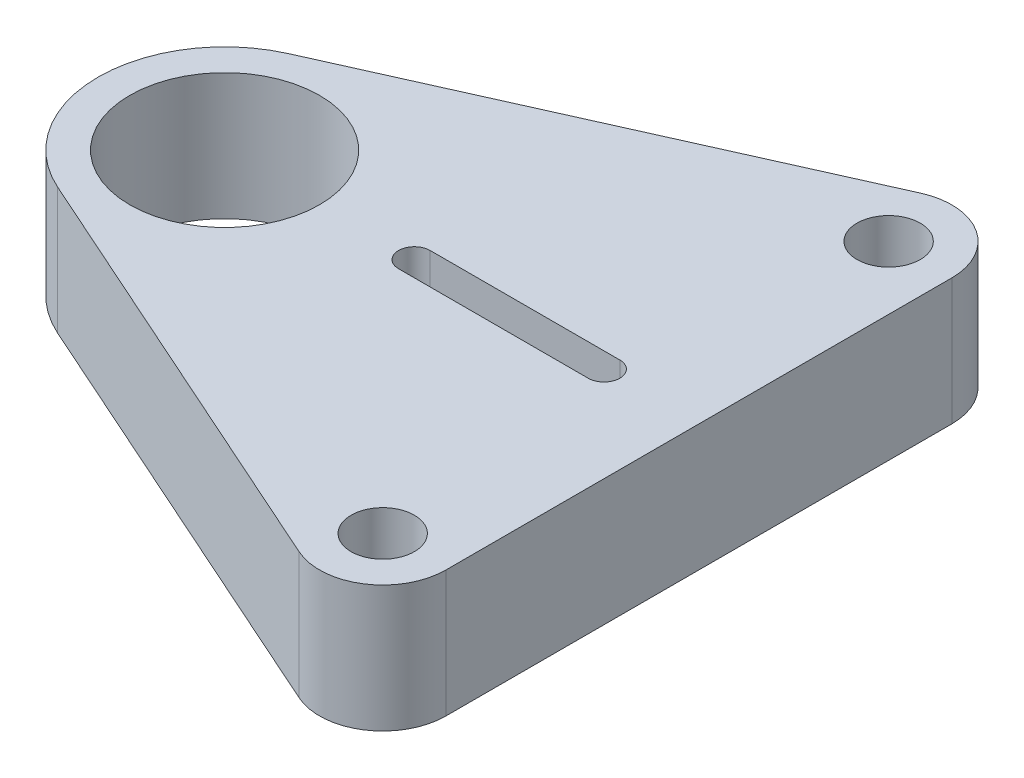
ISO-10303-21;
HEADER;
FILE_DESCRIPTION(('STEP AP214'),'2;1');
FILE_NAME('part.step','',(''),(''),'','','');
FILE_SCHEMA(('AUTOMOTIVE_DESIGN { 1 0 10303 214 1 1 1 1 }'));
ENDSEC;
DATA;
#1=APPLICATION_CONTEXT('core data for automotive mechanical design processes');
#2=APPLICATION_PROTOCOL_DEFINITION('international standard','automotive_design',2000,#1);
#3=PRODUCT_CONTEXT('',#1,'mechanical');
#4=PRODUCT('Part','Part','',(#3));
#5=PRODUCT_RELATED_PRODUCT_CATEGORY('part','',(#4));
#6=PRODUCT_DEFINITION_FORMATION('','',#4);
#7=PRODUCT_DEFINITION_CONTEXT('part definition',#1,'design');
#8=PRODUCT_DEFINITION('design','',#6,#7);
#9=PRODUCT_DEFINITION_SHAPE('','',#8);
#10=(LENGTH_UNIT() NAMED_UNIT(*) SI_UNIT(.MILLI.,.METRE.));
#11=(NAMED_UNIT(*) PLANE_ANGLE_UNIT() SI_UNIT($,.RADIAN.));
#12=(NAMED_UNIT(*) SI_UNIT($,.STERADIAN.) SOLID_ANGLE_UNIT());
#13=UNCERTAINTY_MEASURE_WITH_UNIT(LENGTH_MEASURE(1.E-05),#10,'distance_accuracy_value','');
#14=(GEOMETRIC_REPRESENTATION_CONTEXT(3) GLOBAL_UNCERTAINTY_ASSIGNED_CONTEXT((#13)) GLOBAL_UNIT_ASSIGNED_CONTEXT((#10,
#11,#12)) REPRESENTATION_CONTEXT('',''));
#15=CARTESIAN_POINT('',(0.,0.,0.));
#16=DIRECTION('',(0.,0.,1.));
#17=DIRECTION('',(1.,0.,0.));
#18=AXIS2_PLACEMENT_3D('',#15,#16,#17);
#19=CARTESIAN_POINT('',(0.,-20.,0.));
#20=DIRECTION('',(0.,1.,0.));
#21=DIRECTION('',(0.,0.,1.));
#22=AXIS2_PLACEMENT_3D('',#19,#20,#21);
#23=CYLINDRICAL_SURFACE('',#22,40.);
#24=DIRECTION('',(0.,1.,0.));
#25=VECTOR('',#24,1.);
#26=CARTESIAN_POINT('',(-16.3196510907077,-20.,36.5194330224001));
#27=LINE('',#26,#25);
#28=CARTESIAN_POINT('',(-16.3196510907077,-20.,36.5194330224001));
#29=VERTEX_POINT('',#28);
#30=CARTESIAN_POINT('',(-16.3196510907077,20.,36.5194330224001));
#31=VERTEX_POINT('',#30);
#32=EDGE_CURVE('E46',#29,#31,#27,.T.);
#33=ORIENTED_EDGE('',*,*,#32,.T.);
#34=CARTESIAN_POINT('',(0.,20.,0.));
#35=DIRECTION('',(0.,1.,0.));
#36=DIRECTION('',(0.,0.,1.));
#37=AXIS2_PLACEMENT_3D('',#34,#35,#36);
#38=CIRCLE('',#37,40.);
#39=CARTESIAN_POINT('',(-16.3196510907077,20.,-36.5194330224));
#40=VERTEX_POINT('',#39);
#41=EDGE_CURVE('E168',#40,#31,#38,.T.);
#42=ORIENTED_EDGE('',*,*,#41,.F.);
#43=DIRECTION('',(0.,1.,0.));
#44=VECTOR('',#43,1.);
#45=CARTESIAN_POINT('',(-16.3196510907077,-20.,-36.5194330224));
#46=LINE('',#45,#44);
#47=CARTESIAN_POINT('',(-16.3196510907077,-20.,-36.5194330224));
#48=VERTEX_POINT('',#47);
#49=EDGE_CURVE('E11',#48,#40,#46,.T.);
#50=ORIENTED_EDGE('',*,*,#49,.F.);
#51=CARTESIAN_POINT('',(0.,-20.,0.));
#52=DIRECTION('',(0.,1.,0.));
#53=DIRECTION('',(0.,0.,1.));
#54=AXIS2_PLACEMENT_3D('',#51,#52,#53);
#55=CIRCLE('',#54,40.);
#56=EDGE_CURVE('E221',#48,#29,#55,.T.);
#57=ORIENTED_EDGE('',*,*,#56,.T.);
#58=EDGE_LOOP('',(#33,#42,#50,#57));
#59=FACE_BOUND('',#58,.T.);
#60=ADVANCED_FACE('F43',(#59),#23,.T.);
#61=CARTESIAN_POINT('',(121.840174454646,-20.,-98.2597165112));
#62=DIRECTION('',(-0.407991277267693,0.,-0.912985825560001));
#63=DIRECTION('',(-0.912985825560001,0.,0.407991277267693));
#64=AXIS2_PLACEMENT_3D('',#61,#62,#63);
#65=PLANE('',#64);
#66=ORIENTED_EDGE('',*,*,#49,.T.);
#67=DIRECTION('',(-0.912985825560001,0.,0.407991277267693));
#68=VECTOR('',#67,1.);
#69=CARTESIAN_POINT('',(121.840174454646,20.,-98.2597165112));
#70=LINE('',#69,#68);
#71=CARTESIAN_POINT('',(121.840174454646,20.,-98.2597165112));
#72=VERTEX_POINT('',#71);
#73=EDGE_CURVE('E188',#72,#40,#70,.T.);
#74=ORIENTED_EDGE('',*,*,#73,.F.);
#75=DIRECTION('',(0.,1.,0.));
#76=VECTOR('',#75,1.);
#77=CARTESIAN_POINT('',(121.840174454646,-20.,-98.2597165112));
#78=LINE('',#77,#76);
#79=CARTESIAN_POINT('',(121.840174454646,-20.,-98.2597165112));
#80=VERTEX_POINT('',#79);
#81=EDGE_CURVE('E52',#80,#72,#78,.T.);
#82=ORIENTED_EDGE('',*,*,#81,.F.);
#83=DIRECTION('',(-0.912985825560001,0.,0.407991277267693));
#84=VECTOR('',#83,1.);
#85=CARTESIAN_POINT('',(121.840174454646,-20.,-98.2597165112));
#86=LINE('',#85,#84);
#87=EDGE_CURVE('E240',#80,#48,#86,.T.);
#88=ORIENTED_EDGE('',*,*,#87,.T.);
#89=EDGE_LOOP('',(#66,#74,#82,#88));
#90=FACE_BOUND('',#89,.T.);
#91=ADVANCED_FACE('F264',(#90),#65,.T.);
#92=CARTESIAN_POINT('',(130.,-20.,-80.));
#93=DIRECTION('',(0.,1.,0.));
#94=DIRECTION('',(0.,0.,1.));
#95=AXIS2_PLACEMENT_3D('',#92,#93,#94);
#96=CYLINDRICAL_SURFACE('',#95,20.);
#97=ORIENTED_EDGE('',*,*,#81,.T.);
#98=CARTESIAN_POINT('',(130.,20.,-80.));
#99=DIRECTION('',(0.,1.,0.));
#100=DIRECTION('',(0.,0.,1.));
#101=AXIS2_PLACEMENT_3D('',#98,#99,#100);
#102=CIRCLE('',#101,20.);
#103=CARTESIAN_POINT('',(150.,20.,-80.));
#104=VERTEX_POINT('',#103);
#105=EDGE_CURVE('E184',#104,#72,#102,.T.);
#106=ORIENTED_EDGE('',*,*,#105,.F.);
#107=DIRECTION('',(0.,1.,0.));
#108=VECTOR('',#107,1.);
#109=CARTESIAN_POINT('',(150.,-20.,-80.));
#110=LINE('',#109,#108);
#111=CARTESIAN_POINT('',(150.,-20.,-80.));
#112=VERTEX_POINT('',#111);
#113=EDGE_CURVE('E246',#112,#104,#110,.T.);
#114=ORIENTED_EDGE('',*,*,#113,.F.);
#115=CARTESIAN_POINT('',(130.,-20.,-80.));
#116=DIRECTION('',(0.,1.,0.));
#117=DIRECTION('',(0.,0.,1.));
#118=AXIS2_PLACEMENT_3D('',#115,#116,#117);
#119=CIRCLE('',#118,20.);
#120=EDGE_CURVE('E236',#112,#80,#119,.T.);
#121=ORIENTED_EDGE('',*,*,#120,.T.);
#122=EDGE_LOOP('',(#97,#106,#114,#121));
#123=FACE_BOUND('',#122,.T.);
#124=ADVANCED_FACE('F277',(#123),#96,.T.);
#125=CARTESIAN_POINT('',(150.,-20.,80.));
#126=DIRECTION('',(1.,0.,0.));
#127=DIRECTION('',(0.,0.,-1.));
#128=AXIS2_PLACEMENT_3D('',#125,#126,#127);
#129=PLANE('',#128);
#130=ORIENTED_EDGE('',*,*,#113,.T.);
#131=DIRECTION('',(0.,0.,-1.));
#132=VECTOR('',#131,1.);
#133=CARTESIAN_POINT('',(150.,20.,80.));
#134=LINE('',#133,#132);
#135=CARTESIAN_POINT('',(150.,20.,80.));
#136=VERTEX_POINT('',#135);
#137=EDGE_CURVE('E180',#136,#104,#134,.T.);
#138=ORIENTED_EDGE('',*,*,#137,.F.);
#139=DIRECTION('',(0.,1.,0.));
#140=VECTOR('',#139,1.);
#141=CARTESIAN_POINT('',(150.,-20.,80.));
#142=LINE('',#141,#140);
#143=CARTESIAN_POINT('',(150.,-20.,80.));
#144=VERTEX_POINT('',#143);
#145=EDGE_CURVE('E249',#144,#136,#142,.T.);
#146=ORIENTED_EDGE('',*,*,#145,.F.);
#147=DIRECTION('',(0.,0.,-1.));
#148=VECTOR('',#147,1.);
#149=CARTESIAN_POINT('',(150.,-20.,80.));
#150=LINE('',#149,#148);
#151=EDGE_CURVE('E232',#144,#112,#150,.T.);
#152=ORIENTED_EDGE('',*,*,#151,.T.);
#153=EDGE_LOOP('',(#130,#138,#146,#152));
#154=FACE_BOUND('',#153,.T.);
#155=ADVANCED_FACE('F275',(#154),#129,.T.);
#156=CARTESIAN_POINT('',(130.,-20.,80.));
#157=DIRECTION('',(0.,1.,0.));
#158=DIRECTION('',(0.,0.,1.));
#159=AXIS2_PLACEMENT_3D('',#156,#157,#158);
#160=CYLINDRICAL_SURFACE('',#159,20.);
#161=ORIENTED_EDGE('',*,*,#145,.T.);
#162=CARTESIAN_POINT('',(130.,20.,80.));
#163=DIRECTION('',(0.,1.,0.));
#164=DIRECTION('',(0.,0.,1.));
#165=AXIS2_PLACEMENT_3D('',#162,#163,#164);
#166=CIRCLE('',#165,20.);
#167=CARTESIAN_POINT('',(121.840174454646,20.,98.2597165112));
#168=VERTEX_POINT('',#167);
#169=EDGE_CURVE('E176',#168,#136,#166,.T.);
#170=ORIENTED_EDGE('',*,*,#169,.F.);
#171=DIRECTION('',(0.,1.,0.));
#172=VECTOR('',#171,1.);
#173=CARTESIAN_POINT('',(121.840174454646,-20.,98.2597165112));
#174=LINE('',#173,#172);
#175=CARTESIAN_POINT('',(121.840174454646,-20.,98.2597165112));
#176=VERTEX_POINT('',#175);
#177=EDGE_CURVE('E251',#176,#168,#174,.T.);
#178=ORIENTED_EDGE('',*,*,#177,.F.);
#179=CARTESIAN_POINT('',(130.,-20.,80.));
#180=DIRECTION('',(0.,1.,0.));
#181=DIRECTION('',(0.,0.,1.));
#182=AXIS2_PLACEMENT_3D('',#179,#180,#181);
#183=CIRCLE('',#182,20.);
#184=EDGE_CURVE('E228',#176,#144,#183,.T.);
#185=ORIENTED_EDGE('',*,*,#184,.T.);
#186=EDGE_LOOP('',(#161,#170,#178,#185));
#187=FACE_BOUND('',#186,.T.);
#188=ADVANCED_FACE('F272',(#187),#160,.T.);
#189=CARTESIAN_POINT('',(-16.3196510907077,-20.,36.5194330224001));
#190=DIRECTION('',(-0.407991277267693,0.,0.912985825560001));
#191=DIRECTION('',(0.912985825560001,0.,0.407991277267693));
#192=AXIS2_PLACEMENT_3D('',#189,#190,#191);
#193=PLANE('',#192);
#194=ORIENTED_EDGE('',*,*,#177,.T.);
#195=DIRECTION('',(0.912985825560001,0.,0.407991277267693));
#196=VECTOR('',#195,1.);
#197=CARTESIAN_POINT('',(-16.3196510907077,20.,36.5194330224001));
#198=LINE('',#197,#196);
#199=EDGE_CURVE('E172',#31,#168,#198,.T.);
#200=ORIENTED_EDGE('',*,*,#199,.F.);
#201=ORIENTED_EDGE('',*,*,#32,.F.);
#202=DIRECTION('',(0.912985825560001,0.,0.407991277267693));
#203=VECTOR('',#202,1.);
#204=CARTESIAN_POINT('',(-16.3196510907077,-20.,36.5194330224001));
#205=LINE('',#204,#203);
#206=EDGE_CURVE('E224',#29,#176,#205,.T.);
#207=ORIENTED_EDGE('',*,*,#206,.T.);
#208=EDGE_LOOP('',(#194,#200,#201,#207));
#209=FACE_BOUND('',#208,.T.);
#210=ADVANCED_FACE('F257',(#209),#193,.T.);
#211=CARTESIAN_POINT('',(0.,-20.,0.));
#212=DIRECTION('',(0.,1.,0.));
#213=DIRECTION('',(0.,0.,1.));
#214=AXIS2_PLACEMENT_3D('',#211,#212,#213);
#215=PLANE('',#214);
#216=DIRECTION('',(-1.,0.,0.));
#217=VECTOR('',#216,1.);
#218=CARTESIAN_POINT('',(60.,-20.,-5.));
#219=LINE('',#218,#217);
#220=CARTESIAN_POINT('',(120.,-20.,-5.));
#221=VERTEX_POINT('',#220);
#222=CARTESIAN_POINT('',(60.,-20.,-5.));
#223=VERTEX_POINT('',#222);
#224=EDGE_CURVE('E134',#221,#223,#219,.T.);
#225=ORIENTED_EDGE('',*,*,#224,.T.);
#226=CARTESIAN_POINT('',(60.,-20.,0.));
#227=DIRECTION('',(0.,1.,0.));
#228=DIRECTION('',(0.,0.,1.));
#229=AXIS2_PLACEMENT_3D('',#226,#227,#228);
#230=CIRCLE('',#229,5.);
#231=CARTESIAN_POINT('',(60.,-20.,5.));
#232=VERTEX_POINT('',#231);
#233=EDGE_CURVE('E192',#223,#232,#230,.T.);
#234=ORIENTED_EDGE('',*,*,#233,.T.);
#235=DIRECTION('',(1.,0.,0.));
#236=VECTOR('',#235,1.);
#237=CARTESIAN_POINT('',(60.,-20.,5.));
#238=LINE('',#237,#236);
#239=CARTESIAN_POINT('',(120.,-20.,5.));
#240=VERTEX_POINT('',#239);
#241=EDGE_CURVE('E128',#232,#240,#238,.T.);
#242=ORIENTED_EDGE('',*,*,#241,.T.);
#243=CARTESIAN_POINT('',(120.,-20.,0.));
#244=DIRECTION('',(0.,1.,0.));
#245=DIRECTION('',(0.,0.,1.));
#246=AXIS2_PLACEMENT_3D('',#243,#244,#245);
#247=CIRCLE('',#246,5.);
#248=EDGE_CURVE('E60',#240,#221,#247,.T.);
#249=ORIENTED_EDGE('',*,*,#248,.T.);
#250=EDGE_LOOP('',(#225,#234,#242,#249));
#251=FACE_BOUND('',#250,.T.);
#252=CARTESIAN_POINT('',(130.,-20.,80.));
#253=DIRECTION('',(0.,1.,0.));
#254=DIRECTION('',(0.,0.,1.));
#255=AXIS2_PLACEMENT_3D('',#252,#253,#254);
#256=CIRCLE('',#255,10.);
#257=CARTESIAN_POINT('',(130.,-20.,90.));
#258=VERTEX_POINT('',#257);
#259=EDGE_CURVE('E204',#258,#258,#256,.T.);
#260=ORIENTED_EDGE('',*,*,#259,.T.);
#261=EDGE_LOOP('',(#260));
#262=FACE_BOUND('',#261,.T.);
#263=CARTESIAN_POINT('',(130.,-20.,-80.));
#264=DIRECTION('',(0.,1.,0.));
#265=DIRECTION('',(0.,0.,1.));
#266=AXIS2_PLACEMENT_3D('',#263,#264,#265);
#267=CIRCLE('',#266,10.);
#268=CARTESIAN_POINT('',(130.,-20.,-70.));
#269=VERTEX_POINT('',#268);
#270=EDGE_CURVE('E213',#269,#269,#267,.T.);
#271=ORIENTED_EDGE('',*,*,#270,.T.);
#272=EDGE_LOOP('',(#271));
#273=FACE_BOUND('',#272,.T.);
#274=CARTESIAN_POINT('',(0.,-20.,0.));
#275=DIRECTION('',(0.,1.,0.));
#276=DIRECTION('',(0.,0.,1.));
#277=AXIS2_PLACEMENT_3D('',#274,#275,#276);
#278=CIRCLE('',#277,30.);
#279=CARTESIAN_POINT('',(0.,-20.,30.));
#280=VERTEX_POINT('',#279);
#281=EDGE_CURVE('E217',#280,#280,#278,.T.);
#282=ORIENTED_EDGE('',*,*,#281,.T.);
#283=EDGE_LOOP('',(#282));
#284=FACE_BOUND('',#283,.T.);
#285=ORIENTED_EDGE('',*,*,#56,.F.);
#286=ORIENTED_EDGE('',*,*,#87,.F.);
#287=ORIENTED_EDGE('',*,*,#120,.F.);
#288=ORIENTED_EDGE('',*,*,#151,.F.);
#289=ORIENTED_EDGE('',*,*,#184,.F.);
#290=ORIENTED_EDGE('',*,*,#206,.F.);
#291=EDGE_LOOP('',(#285,#286,#287,#288,#289,#290));
#292=FACE_BOUND('',#291,.T.);
#293=ADVANCED_FACE('F268',(#251,#262,#273,#284,#292),#215,.F.);
#294=CARTESIAN_POINT('',(0.,-20.,0.));
#295=DIRECTION('',(0.,1.,0.));
#296=DIRECTION('',(0.,0.,1.));
#297=AXIS2_PLACEMENT_3D('',#294,#295,#296);
#298=CYLINDRICAL_SURFACE('',#297,30.);
#299=ORIENTED_EDGE('',*,*,#281,.F.);
#300=EDGE_LOOP('',(#299));
#301=FACE_BOUND('',#300,.T.);
#302=CARTESIAN_POINT('',(0.,20.,0.));
#303=DIRECTION('',(0.,1.,0.));
#304=DIRECTION('',(0.,0.,1.));
#305=AXIS2_PLACEMENT_3D('',#302,#303,#304);
#306=CIRCLE('',#305,30.);
#307=CARTESIAN_POINT('',(0.,20.,30.));
#308=VERTEX_POINT('',#307);
#309=EDGE_CURVE('E164',#308,#308,#306,.T.);
#310=ORIENTED_EDGE('',*,*,#309,.T.);
#311=EDGE_LOOP('',(#310));
#312=FACE_BOUND('',#311,.T.);
#313=ADVANCED_FACE('F332',(#301,#312),#298,.F.);
#314=CARTESIAN_POINT('',(130.,-20.,-80.));
#315=DIRECTION('',(0.,1.,0.));
#316=DIRECTION('',(0.,0.,1.));
#317=AXIS2_PLACEMENT_3D('',#314,#315,#316);
#318=CYLINDRICAL_SURFACE('',#317,10.);
#319=ORIENTED_EDGE('',*,*,#270,.F.);
#320=EDGE_LOOP('',(#319));
#321=FACE_BOUND('',#320,.T.);
#322=CARTESIAN_POINT('',(130.,20.,-80.));
#323=DIRECTION('',(0.,1.,0.));
#324=DIRECTION('',(0.,0.,1.));
#325=AXIS2_PLACEMENT_3D('',#322,#323,#324);
#326=CIRCLE('',#325,10.);
#327=CARTESIAN_POINT('',(130.,20.,-70.));
#328=VERTEX_POINT('',#327);
#329=EDGE_CURVE('E160',#328,#328,#326,.T.);
#330=ORIENTED_EDGE('',*,*,#329,.T.);
#331=EDGE_LOOP('',(#330));
#332=FACE_BOUND('',#331,.T.);
#333=ADVANCED_FACE('F343',(#321,#332),#318,.F.);
#334=CARTESIAN_POINT('',(130.,-20.,80.));
#335=DIRECTION('',(0.,1.,0.));
#336=DIRECTION('',(0.,0.,1.));
#337=AXIS2_PLACEMENT_3D('',#334,#335,#336);
#338=CYLINDRICAL_SURFACE('',#337,10.);
#339=ORIENTED_EDGE('',*,*,#259,.F.);
#340=EDGE_LOOP('',(#339));
#341=FACE_BOUND('',#340,.T.);
#342=CARTESIAN_POINT('',(130.,20.,80.));
#343=DIRECTION('',(0.,1.,0.));
#344=DIRECTION('',(0.,0.,1.));
#345=AXIS2_PLACEMENT_3D('',#342,#343,#344);
#346=CIRCLE('',#345,10.);
#347=CARTESIAN_POINT('',(130.,20.,90.));
#348=VERTEX_POINT('',#347);
#349=EDGE_CURVE('E156',#348,#348,#346,.T.);
#350=ORIENTED_EDGE('',*,*,#349,.T.);
#351=EDGE_LOOP('',(#350));
#352=FACE_BOUND('',#351,.T.);
#353=ADVANCED_FACE('F354',(#341,#352),#338,.F.);
#354=CARTESIAN_POINT('',(60.,-20.,0.));
#355=DIRECTION('',(0.,1.,0.));
#356=DIRECTION('',(0.,0.,1.));
#357=AXIS2_PLACEMENT_3D('',#354,#355,#356);
#358=CYLINDRICAL_SURFACE('',#357,5.);
#359=DIRECTION('',(0.,1.,0.));
#360=VECTOR('',#359,1.);
#361=CARTESIAN_POINT('',(60.,-20.,-5.));
#362=LINE('',#361,#360);
#363=CARTESIAN_POINT('',(60.,20.,-5.));
#364=VERTEX_POINT('',#363);
#365=EDGE_CURVE('E139',#223,#364,#362,.T.);
#366=ORIENTED_EDGE('',*,*,#365,.T.);
#367=CARTESIAN_POINT('',(60.,20.,0.));
#368=DIRECTION('',(0.,1.,0.));
#369=DIRECTION('',(0.,0.,1.));
#370=AXIS2_PLACEMENT_3D('',#367,#368,#369);
#371=CIRCLE('',#370,5.);
#372=CARTESIAN_POINT('',(60.,20.,5.));
#373=VERTEX_POINT('',#372);
#374=EDGE_CURVE('E137',#364,#373,#371,.T.);
#375=ORIENTED_EDGE('',*,*,#374,.T.);
#376=DIRECTION('',(0.,1.,0.));
#377=VECTOR('',#376,1.);
#378=CARTESIAN_POINT('',(60.,-20.,5.));
#379=LINE('',#378,#377);
#380=EDGE_CURVE('E121',#232,#373,#379,.T.);
#381=ORIENTED_EDGE('',*,*,#380,.F.);
#382=ORIENTED_EDGE('',*,*,#233,.F.);
#383=EDGE_LOOP('',(#366,#375,#381,#382));
#384=FACE_BOUND('',#383,.T.);
#385=ADVANCED_FACE('F138',(#384),#358,.F.);
#386=CARTESIAN_POINT('',(60.,-20.,-5.));
#387=DIRECTION('',(0.,0.,-1.));
#388=DIRECTION('',(-1.,0.,0.));
#389=AXIS2_PLACEMENT_3D('',#386,#387,#388);
#390=PLANE('',#389);
#391=DIRECTION('',(0.,1.,0.));
#392=VECTOR('',#391,1.);
#393=CARTESIAN_POINT('',(120.,-20.,-5.));
#394=LINE('',#393,#392);
#395=CARTESIAN_POINT('',(120.,20.,-5.));
#396=VERTEX_POINT('',#395);
#397=EDGE_CURVE('E205',#221,#396,#394,.T.);
#398=ORIENTED_EDGE('',*,*,#397,.T.);
#399=DIRECTION('',(-1.,0.,0.));
#400=VECTOR('',#399,1.);
#401=CARTESIAN_POINT('',(60.,20.,-5.));
#402=LINE('',#401,#400);
#403=EDGE_CURVE('E151',#396,#364,#402,.T.);
#404=ORIENTED_EDGE('',*,*,#403,.T.);
#405=ORIENTED_EDGE('',*,*,#365,.F.);
#406=ORIENTED_EDGE('',*,*,#224,.F.);
#407=EDGE_LOOP('',(#398,#404,#405,#406));
#408=FACE_BOUND('',#407,.T.);
#409=ADVANCED_FACE('F375',(#408),#390,.F.);
#410=CARTESIAN_POINT('',(120.,-20.,0.));
#411=DIRECTION('',(0.,1.,0.));
#412=DIRECTION('',(0.,0.,1.));
#413=AXIS2_PLACEMENT_3D('',#410,#411,#412);
#414=CYLINDRICAL_SURFACE('',#413,5.);
#415=DIRECTION('',(0.,1.,0.));
#416=VECTOR('',#415,1.);
#417=CARTESIAN_POINT('',(120.,-20.,5.));
#418=LINE('',#417,#416);
#419=CARTESIAN_POINT('',(120.,20.,5.));
#420=VERTEX_POINT('',#419);
#421=EDGE_CURVE('E133',#240,#420,#418,.T.);
#422=ORIENTED_EDGE('',*,*,#421,.T.);
#423=CARTESIAN_POINT('',(120.,20.,0.));
#424=DIRECTION('',(0.,1.,0.));
#425=DIRECTION('',(0.,0.,1.));
#426=AXIS2_PLACEMENT_3D('',#423,#424,#425);
#427=CIRCLE('',#426,5.);
#428=EDGE_CURVE('E147',#420,#396,#427,.T.);
#429=ORIENTED_EDGE('',*,*,#428,.T.);
#430=ORIENTED_EDGE('',*,*,#397,.F.);
#431=ORIENTED_EDGE('',*,*,#248,.F.);
#432=EDGE_LOOP('',(#422,#429,#430,#431));
#433=FACE_BOUND('',#432,.T.);
#434=ADVANCED_FACE('F385',(#433),#414,.F.);
#435=CARTESIAN_POINT('',(60.,-20.,5.));
#436=DIRECTION('',(0.,0.,1.));
#437=DIRECTION('',(1.,0.,0.));
#438=AXIS2_PLACEMENT_3D('',#435,#436,#437);
#439=PLANE('',#438);
#440=ORIENTED_EDGE('',*,*,#380,.T.);
#441=DIRECTION('',(1.,0.,0.));
#442=VECTOR('',#441,1.);
#443=CARTESIAN_POINT('',(60.,20.,5.));
#444=LINE('',#443,#442);
#445=EDGE_CURVE('E125',#373,#420,#444,.T.);
#446=ORIENTED_EDGE('',*,*,#445,.T.);
#447=ORIENTED_EDGE('',*,*,#421,.F.);
#448=ORIENTED_EDGE('',*,*,#241,.F.);
#449=EDGE_LOOP('',(#440,#446,#447,#448));
#450=FACE_BOUND('',#449,.T.);
#451=ADVANCED_FACE('F123',(#450),#439,.F.);
#452=CARTESIAN_POINT('',(0.,20.,0.));
#453=DIRECTION('',(0.,1.,0.));
#454=DIRECTION('',(0.,0.,1.));
#455=AXIS2_PLACEMENT_3D('',#452,#453,#454);
#456=PLANE('',#455);
#457=ORIENTED_EDGE('',*,*,#329,.F.);
#458=EDGE_LOOP('',(#457));
#459=FACE_BOUND('',#458,.T.);
#460=ORIENTED_EDGE('',*,*,#41,.T.);
#461=ORIENTED_EDGE('',*,*,#199,.T.);
#462=ORIENTED_EDGE('',*,*,#169,.T.);
#463=ORIENTED_EDGE('',*,*,#137,.T.);
#464=ORIENTED_EDGE('',*,*,#105,.T.);
#465=ORIENTED_EDGE('',*,*,#73,.T.);
#466=EDGE_LOOP('',(#460,#461,#462,#463,#464,#465));
#467=FACE_BOUND('',#466,.T.);
#468=ORIENTED_EDGE('',*,*,#309,.F.);
#469=EDGE_LOOP('',(#468));
#470=FACE_BOUND('',#469,.T.);
#471=ORIENTED_EDGE('',*,*,#349,.F.);
#472=EDGE_LOOP('',(#471));
#473=FACE_BOUND('',#472,.T.);
#474=ORIENTED_EDGE('',*,*,#445,.F.);
#475=ORIENTED_EDGE('',*,*,#374,.F.);
#476=ORIENTED_EDGE('',*,*,#403,.F.);
#477=ORIENTED_EDGE('',*,*,#428,.F.);
#478=EDGE_LOOP('',(#474,#475,#476,#477));
#479=FACE_BOUND('',#478,.T.);
#480=ADVANCED_FACE('F145',(#459,#467,#470,#473,#479),#456,.T.);
#481=CLOSED_SHELL('',(#60,#91,#124,#155,#188,#210,#293,#313,#333,#353,#385,#409,#434,#451,#480));
#482=MANIFOLD_SOLID_BREP('B2',#481);
#483=ADVANCED_BREP_SHAPE_REPRESENTATION('',(#18,#482),#14);
#484=SHAPE_DEFINITION_REPRESENTATION(#9,#483);
ENDSEC;
END-ISO-10303-21;
